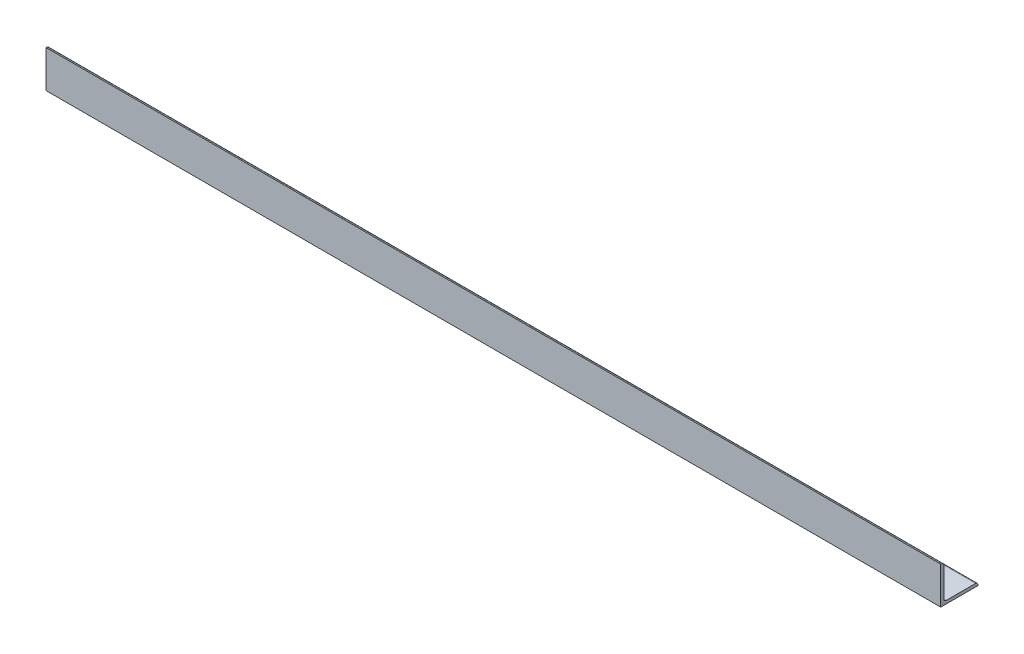
ISO-10303-21;
HEADER;
FILE_DESCRIPTION(('STEP AP214'),'2;1');
FILE_NAME('part.step','',(''),(''),'','','');
FILE_SCHEMA(('AUTOMOTIVE_DESIGN { 1 0 10303 214 1 1 1 1 }'));
ENDSEC;
DATA;
#1=APPLICATION_CONTEXT('core data for automotive mechanical design processes');
#2=APPLICATION_PROTOCOL_DEFINITION('international standard','automotive_design',2000,#1);
#3=PRODUCT_CONTEXT('',#1,'mechanical');
#4=PRODUCT('Part','Part','',(#3));
#5=PRODUCT_RELATED_PRODUCT_CATEGORY('part','',(#4));
#6=PRODUCT_DEFINITION_FORMATION('','',#4);
#7=PRODUCT_DEFINITION_CONTEXT('part definition',#1,'design');
#8=PRODUCT_DEFINITION('design','',#6,#7);
#9=PRODUCT_DEFINITION_SHAPE('','',#8);
#10=(LENGTH_UNIT() NAMED_UNIT(*) SI_UNIT(.MILLI.,.METRE.));
#11=(NAMED_UNIT(*) PLANE_ANGLE_UNIT() SI_UNIT($,.RADIAN.));
#12=(NAMED_UNIT(*) SI_UNIT($,.STERADIAN.) SOLID_ANGLE_UNIT());
#13=UNCERTAINTY_MEASURE_WITH_UNIT(LENGTH_MEASURE(1.E-05),#10,'distance_accuracy_value','');
#14=(GEOMETRIC_REPRESENTATION_CONTEXT(3) GLOBAL_UNCERTAINTY_ASSIGNED_CONTEXT((#13)) GLOBAL_UNIT_ASSIGNED_CONTEXT((#10,
#11,#12)) REPRESENTATION_CONTEXT('',''));
#15=CARTESIAN_POINT('',(0.,0.,0.));
#16=DIRECTION('',(0.,0.,1.));
#17=DIRECTION('',(1.,0.,0.));
#18=AXIS2_PLACEMENT_3D('',#15,#16,#17);
#19=CARTESIAN_POINT('',(-914.4,76.2,0.));
#20=DIRECTION('',(0.,1.,0.));
#21=DIRECTION('',(0.,0.,1.));
#22=AXIS2_PLACEMENT_3D('',#19,#20,#21);
#23=PLANE('',#22);
#24=DIRECTION('',(1.,0.,0.));
#25=VECTOR('',#24,1.);
#26=CARTESIAN_POINT('',(-914.4,76.2,0.));
#27=LINE('',#26,#25);
#28=CARTESIAN_POINT('',(-914.4,76.2,0.));
#29=VERTEX_POINT('',#28);
#30=CARTESIAN_POINT('',(914.4,76.2,0.));
#31=VERTEX_POINT('',#30);
#32=EDGE_CURVE('E36',#29,#31,#27,.T.);
#33=ORIENTED_EDGE('',*,*,#32,.T.);
#34=DIRECTION('',(0.,0.,1.));
#35=VECTOR('',#34,1.);
#36=CARTESIAN_POINT('',(914.4,76.2,0.));
#37=LINE('',#36,#35);
#38=CARTESIAN_POINT('',(914.4,76.2,-1.26999999999996));
#39=VERTEX_POINT('',#38);
#40=EDGE_CURVE('E103',#39,#31,#37,.T.);
#41=ORIENTED_EDGE('',*,*,#40,.F.);
#42=DIRECTION('',(1.,0.,0.));
#43=VECTOR('',#42,1.);
#44=CARTESIAN_POINT('',(-914.4,76.2,-1.26999999999996));
#45=LINE('',#44,#43);
#46=CARTESIAN_POINT('',(-914.4,76.2,-1.26999999999996));
#47=VERTEX_POINT('',#46);
#48=EDGE_CURVE('E11',#47,#39,#45,.T.);
#49=ORIENTED_EDGE('',*,*,#48,.F.);
#50=DIRECTION('',(0.,0.,1.));
#51=VECTOR('',#50,1.);
#52=CARTESIAN_POINT('',(-914.4,76.2,0.));
#53=LINE('',#52,#51);
#54=EDGE_CURVE('E104',#47,#29,#53,.T.);
#55=ORIENTED_EDGE('',*,*,#54,.T.);
#56=EDGE_LOOP('',(#33,#41,#49,#55));
#57=FACE_BOUND('',#56,.T.);
#58=ADVANCED_FACE('F33',(#57),#23,.T.);
#59=CARTESIAN_POINT('',(-914.4,71.12,-1.27));
#60=DIRECTION('',(1.,0.,0.));
#61=DIRECTION('',(0.,0.,-1.));
#62=AXIS2_PLACEMENT_3D('',#59,#60,#61);
#63=CYLINDRICAL_SURFACE('',#62,5.08);
#64=ORIENTED_EDGE('',*,*,#48,.T.);
#65=CARTESIAN_POINT('',(914.4,71.12,-1.27));
#66=DIRECTION('',(1.,0.,0.));
#67=DIRECTION('',(0.,0.,-1.));
#68=AXIS2_PLACEMENT_3D('',#65,#66,#67);
#69=CIRCLE('',#68,5.08);
#70=CARTESIAN_POINT('',(914.4,71.12,-6.35));
#71=VERTEX_POINT('',#70);
#72=EDGE_CURVE('E121',#71,#39,#69,.T.);
#73=ORIENTED_EDGE('',*,*,#72,.F.);
#74=DIRECTION('',(1.,0.,0.));
#75=VECTOR('',#74,1.);
#76=CARTESIAN_POINT('',(-914.4,71.12,-6.35));
#77=LINE('',#76,#75);
#78=CARTESIAN_POINT('',(-914.4,71.12,-6.35));
#79=VERTEX_POINT('',#78);
#80=EDGE_CURVE('E41',#79,#71,#77,.T.);
#81=ORIENTED_EDGE('',*,*,#80,.F.);
#82=CARTESIAN_POINT('',(-914.4,71.12,-1.27));
#83=DIRECTION('',(1.,0.,0.));
#84=DIRECTION('',(0.,0.,-1.));
#85=AXIS2_PLACEMENT_3D('',#82,#83,#84);
#86=CIRCLE('',#85,5.08);
#87=EDGE_CURVE('E109',#79,#47,#86,.T.);
#88=ORIENTED_EDGE('',*,*,#87,.T.);
#89=EDGE_LOOP('',(#64,#73,#81,#88));
#90=FACE_BOUND('',#89,.T.);
#91=ADVANCED_FACE('F197',(#90),#63,.T.);
#92=CARTESIAN_POINT('',(-914.4,71.12,-6.35));
#93=DIRECTION('',(0.,0.,-1.));
#94=DIRECTION('',(-1.,0.,0.));
#95=AXIS2_PLACEMENT_3D('',#92,#93,#94);
#96=PLANE('',#95);
#97=ORIENTED_EDGE('',*,*,#80,.T.);
#98=DIRECTION('',(0.,1.,0.));
#99=VECTOR('',#98,1.);
#100=CARTESIAN_POINT('',(914.4,71.12,-6.35));
#101=LINE('',#100,#99);
#102=CARTESIAN_POINT('',(914.4,11.43,-6.35));
#103=VERTEX_POINT('',#102);
#104=EDGE_CURVE('E137',#103,#71,#101,.T.);
#105=ORIENTED_EDGE('',*,*,#104,.F.);
#106=DIRECTION('',(1.,0.,0.));
#107=VECTOR('',#106,1.);
#108=CARTESIAN_POINT('',(-914.4,11.43,-6.35));
#109=LINE('',#108,#107);
#110=CARTESIAN_POINT('',(-914.4,11.43,-6.35));
#111=VERTEX_POINT('',#110);
#112=EDGE_CURVE('E162',#111,#103,#109,.T.);
#113=ORIENTED_EDGE('',*,*,#112,.F.);
#114=DIRECTION('',(0.,1.,0.));
#115=VECTOR('',#114,1.);
#116=CARTESIAN_POINT('',(-914.4,71.12,-6.35));
#117=LINE('',#116,#115);
#118=EDGE_CURVE('E158',#111,#79,#117,.T.);
#119=ORIENTED_EDGE('',*,*,#118,.T.);
#120=EDGE_LOOP('',(#97,#105,#113,#119));
#121=FACE_BOUND('',#120,.T.);
#122=ADVANCED_FACE('F195',(#121),#96,.T.);
#123=CARTESIAN_POINT('',(-914.4,11.43,-11.43));
#124=DIRECTION('',(1.,0.,0.));
#125=DIRECTION('',(0.,0.,-1.));
#126=AXIS2_PLACEMENT_3D('',#123,#124,#125);
#127=CYLINDRICAL_SURFACE('',#126,5.08);
#128=ORIENTED_EDGE('',*,*,#112,.T.);
#129=CARTESIAN_POINT('',(914.4,11.43,-11.43));
#130=DIRECTION('',(-1.,0.,0.));
#131=DIRECTION('',(0.,0.,-1.));
#132=AXIS2_PLACEMENT_3D('',#129,#130,#131);
#133=CIRCLE('',#132,5.08);
#134=CARTESIAN_POINT('',(914.4,6.35,-11.43));
#135=VERTEX_POINT('',#134);
#136=EDGE_CURVE('E134',#135,#103,#133,.T.);
#137=ORIENTED_EDGE('',*,*,#136,.F.);
#138=DIRECTION('',(1.,0.,0.));
#139=VECTOR('',#138,1.);
#140=CARTESIAN_POINT('',(-914.4,6.35,-11.43));
#141=LINE('',#140,#139);
#142=CARTESIAN_POINT('',(-914.4,6.35,-11.43));
#143=VERTEX_POINT('',#142);
#144=EDGE_CURVE('E164',#143,#135,#141,.T.);
#145=ORIENTED_EDGE('',*,*,#144,.F.);
#146=CARTESIAN_POINT('',(-914.4,11.43,-11.43));
#147=DIRECTION('',(-1.,0.,0.));
#148=DIRECTION('',(0.,0.,-1.));
#149=AXIS2_PLACEMENT_3D('',#146,#147,#148);
#150=CIRCLE('',#149,5.08);
#151=EDGE_CURVE('E155',#143,#111,#150,.T.);
#152=ORIENTED_EDGE('',*,*,#151,.T.);
#153=EDGE_LOOP('',(#128,#137,#145,#152));
#154=FACE_BOUND('',#153,.T.);
#155=ADVANCED_FACE('F193',(#154),#127,.F.);
#156=CARTESIAN_POINT('',(-914.4,6.35,-11.43));
#157=DIRECTION('',(0.,1.,0.));
#158=DIRECTION('',(0.,0.,1.));
#159=AXIS2_PLACEMENT_3D('',#156,#157,#158);
#160=PLANE('',#159);
#161=ORIENTED_EDGE('',*,*,#144,.T.);
#162=DIRECTION('',(0.,0.,1.));
#163=VECTOR('',#162,1.);
#164=CARTESIAN_POINT('',(914.4,6.35,-11.43));
#165=LINE('',#164,#163);
#166=CARTESIAN_POINT('',(914.4,6.35,-71.12));
#167=VERTEX_POINT('',#166);
#168=EDGE_CURVE('E131',#167,#135,#165,.T.);
#169=ORIENTED_EDGE('',*,*,#168,.F.);
#170=DIRECTION('',(1.,0.,0.));
#171=VECTOR('',#170,1.);
#172=CARTESIAN_POINT('',(-914.4,6.35,-71.12));
#173=LINE('',#172,#171);
#174=CARTESIAN_POINT('',(-914.4,6.35,-71.12));
#175=VERTEX_POINT('',#174);
#176=EDGE_CURVE('E166',#175,#167,#173,.T.);
#177=ORIENTED_EDGE('',*,*,#176,.F.);
#178=DIRECTION('',(0.,0.,1.));
#179=VECTOR('',#178,1.);
#180=CARTESIAN_POINT('',(-914.4,6.35,-11.43));
#181=LINE('',#180,#179);
#182=EDGE_CURVE('E152',#175,#143,#181,.T.);
#183=ORIENTED_EDGE('',*,*,#182,.T.);
#184=EDGE_LOOP('',(#161,#169,#177,#183));
#185=FACE_BOUND('',#184,.T.);
#186=ADVANCED_FACE('F188',(#185),#160,.T.);
#187=CARTESIAN_POINT('',(-914.4,1.27,-71.12));
#188=DIRECTION('',(1.,0.,0.));
#189=DIRECTION('',(0.,0.,-1.));
#190=AXIS2_PLACEMENT_3D('',#187,#188,#189);
#191=CYLINDRICAL_SURFACE('',#190,5.08);
#192=ORIENTED_EDGE('',*,*,#176,.T.);
#193=CARTESIAN_POINT('',(914.4,1.27,-71.12));
#194=DIRECTION('',(1.,0.,0.));
#195=DIRECTION('',(0.,0.,1.));
#196=AXIS2_PLACEMENT_3D('',#193,#194,#195);
#197=CIRCLE('',#196,5.08);
#198=CARTESIAN_POINT('',(914.4,1.26999999999996,-76.2));
#199=VERTEX_POINT('',#198);
#200=EDGE_CURVE('E128',#199,#167,#197,.T.);
#201=ORIENTED_EDGE('',*,*,#200,.F.);
#202=DIRECTION('',(1.,0.,0.));
#203=VECTOR('',#202,1.);
#204=CARTESIAN_POINT('',(-914.4,1.26999999999996,-76.2));
#205=LINE('',#204,#203);
#206=CARTESIAN_POINT('',(-914.4,1.26999999999996,-76.2));
#207=VERTEX_POINT('',#206);
#208=EDGE_CURVE('E168',#207,#199,#205,.T.);
#209=ORIENTED_EDGE('',*,*,#208,.F.);
#210=CARTESIAN_POINT('',(-914.4,1.27,-71.12));
#211=DIRECTION('',(1.,0.,0.));
#212=DIRECTION('',(0.,0.,1.));
#213=AXIS2_PLACEMENT_3D('',#210,#211,#212);
#214=CIRCLE('',#213,5.08);
#215=EDGE_CURVE('E149',#207,#175,#214,.T.);
#216=ORIENTED_EDGE('',*,*,#215,.T.);
#217=EDGE_LOOP('',(#192,#201,#209,#216));
#218=FACE_BOUND('',#217,.T.);
#219=ADVANCED_FACE('F181',(#218),#191,.T.);
#220=CARTESIAN_POINT('',(-914.4,1.26999999999996,-76.2));
#221=DIRECTION('',(0.,0.,-1.));
#222=DIRECTION('',(-1.,0.,0.));
#223=AXIS2_PLACEMENT_3D('',#220,#221,#222);
#224=PLANE('',#223);
#225=ORIENTED_EDGE('',*,*,#208,.T.);
#226=DIRECTION('',(0.,1.,0.));
#227=VECTOR('',#226,1.);
#228=CARTESIAN_POINT('',(914.4,1.26999999999996,-76.2));
#229=LINE('',#228,#227);
#230=CARTESIAN_POINT('',(914.4,0.,-76.2));
#231=VERTEX_POINT('',#230);
#232=EDGE_CURVE('E125',#231,#199,#229,.T.);
#233=ORIENTED_EDGE('',*,*,#232,.F.);
#234=DIRECTION('',(1.,0.,0.));
#235=VECTOR('',#234,1.);
#236=CARTESIAN_POINT('',(-914.4,0.,-76.2));
#237=LINE('',#236,#235);
#238=CARTESIAN_POINT('',(-914.4,0.,-76.2));
#239=VERTEX_POINT('',#238);
#240=EDGE_CURVE('E170',#239,#231,#237,.T.);
#241=ORIENTED_EDGE('',*,*,#240,.F.);
#242=DIRECTION('',(0.,1.,0.));
#243=VECTOR('',#242,1.);
#244=CARTESIAN_POINT('',(-914.4,1.26999999999996,-76.2));
#245=LINE('',#244,#243);
#246=EDGE_CURVE('E146',#239,#207,#245,.T.);
#247=ORIENTED_EDGE('',*,*,#246,.T.);
#248=EDGE_LOOP('',(#225,#233,#241,#247));
#249=FACE_BOUND('',#248,.T.);
#250=ADVANCED_FACE('F178',(#249),#224,.T.);
#251=CARTESIAN_POINT('',(-914.4,0.,0.));
#252=DIRECTION('',(0.,-1.,0.));
#253=DIRECTION('',(0.,0.,-1.));
#254=AXIS2_PLACEMENT_3D('',#251,#252,#253);
#255=PLANE('',#254);
#256=ORIENTED_EDGE('',*,*,#240,.T.);
#257=DIRECTION('',(0.,0.,-1.));
#258=VECTOR('',#257,1.);
#259=CARTESIAN_POINT('',(914.4,0.,0.));
#260=LINE('',#259,#258);
#261=CARTESIAN_POINT('',(914.4,0.,0.));
#262=VERTEX_POINT('',#261);
#263=EDGE_CURVE('E116',#262,#231,#260,.T.);
#264=ORIENTED_EDGE('',*,*,#263,.F.);
#265=DIRECTION('',(1.,0.,0.));
#266=VECTOR('',#265,1.);
#267=CARTESIAN_POINT('',(-914.4,0.,0.));
#268=LINE('',#267,#266);
#269=CARTESIAN_POINT('',(-914.4,0.,0.));
#270=VERTEX_POINT('',#269);
#271=EDGE_CURVE('E108',#270,#262,#268,.T.);
#272=ORIENTED_EDGE('',*,*,#271,.F.);
#273=DIRECTION('',(0.,0.,-1.));
#274=VECTOR('',#273,1.);
#275=CARTESIAN_POINT('',(-914.4,0.,0.));
#276=LINE('',#275,#274);
#277=EDGE_CURVE('E143',#270,#239,#276,.T.);
#278=ORIENTED_EDGE('',*,*,#277,.T.);
#279=EDGE_LOOP('',(#256,#264,#272,#278));
#280=FACE_BOUND('',#279,.T.);
#281=ADVANCED_FACE('F172',(#280),#255,.T.);
#282=CARTESIAN_POINT('',(-914.4,76.2,0.));
#283=DIRECTION('',(0.,0.,1.));
#284=DIRECTION('',(1.,0.,0.));
#285=AXIS2_PLACEMENT_3D('',#282,#283,#284);
#286=PLANE('',#285);
#287=ORIENTED_EDGE('',*,*,#271,.T.);
#288=DIRECTION('',(0.,-1.,0.));
#289=VECTOR('',#288,1.);
#290=CARTESIAN_POINT('',(914.4,76.2,0.));
#291=LINE('',#290,#289);
#292=EDGE_CURVE('E111',#31,#262,#291,.T.);
#293=ORIENTED_EDGE('',*,*,#292,.F.);
#294=ORIENTED_EDGE('',*,*,#32,.F.);
#295=DIRECTION('',(0.,-1.,0.));
#296=VECTOR('',#295,1.);
#297=CARTESIAN_POINT('',(-914.4,76.2,0.));
#298=LINE('',#297,#296);
#299=EDGE_CURVE('E141',#29,#270,#298,.T.);
#300=ORIENTED_EDGE('',*,*,#299,.T.);
#301=EDGE_LOOP('',(#287,#293,#294,#300));
#302=FACE_BOUND('',#301,.T.);
#303=ADVANCED_FACE('F112',(#302),#286,.T.);
#304=CARTESIAN_POINT('',(-914.4,71.12,-1.27));
#305=DIRECTION('',(1.,0.,0.));
#306=DIRECTION('',(0.,0.,-1.));
#307=AXIS2_PLACEMENT_3D('',#304,#305,#306);
#308=PLANE('',#307);
#309=ORIENTED_EDGE('',*,*,#54,.F.);
#310=ORIENTED_EDGE('',*,*,#87,.F.);
#311=ORIENTED_EDGE('',*,*,#118,.F.);
#312=ORIENTED_EDGE('',*,*,#151,.F.);
#313=ORIENTED_EDGE('',*,*,#182,.F.);
#314=ORIENTED_EDGE('',*,*,#215,.F.);
#315=ORIENTED_EDGE('',*,*,#246,.F.);
#316=ORIENTED_EDGE('',*,*,#277,.F.);
#317=ORIENTED_EDGE('',*,*,#299,.F.);
#318=EDGE_LOOP('',(#309,#310,#311,#312,#313,#314,#315,#316,#317));
#319=FACE_BOUND('',#318,.T.);
#320=ADVANCED_FACE('F184',(#319),#308,.F.);
#321=CARTESIAN_POINT('',(914.4,71.12,-1.27));
#322=DIRECTION('',(1.,0.,0.));
#323=DIRECTION('',(0.,0.,-1.));
#324=AXIS2_PLACEMENT_3D('',#321,#322,#323);
#325=PLANE('',#324);
#326=ORIENTED_EDGE('',*,*,#40,.T.);
#327=ORIENTED_EDGE('',*,*,#292,.T.);
#328=ORIENTED_EDGE('',*,*,#263,.T.);
#329=ORIENTED_EDGE('',*,*,#232,.T.);
#330=ORIENTED_EDGE('',*,*,#200,.T.);
#331=ORIENTED_EDGE('',*,*,#168,.T.);
#332=ORIENTED_EDGE('',*,*,#136,.T.);
#333=ORIENTED_EDGE('',*,*,#104,.T.);
#334=ORIENTED_EDGE('',*,*,#72,.T.);
#335=EDGE_LOOP('',(#326,#327,#328,#329,#330,#331,#332,#333,#334));
#336=FACE_BOUND('',#335,.T.);
#337=ADVANCED_FACE('F119',(#336),#325,.T.);
#338=CLOSED_SHELL('',(#58,#91,#122,#155,#186,#219,#250,#281,#303,#320,#337));
#339=MANIFOLD_SOLID_BREP('B2',#338);
#340=ADVANCED_BREP_SHAPE_REPRESENTATION('',(#18,#339),#14);
#341=SHAPE_DEFINITION_REPRESENTATION(#9,#340);
ENDSEC;
END-ISO-10303-21;
